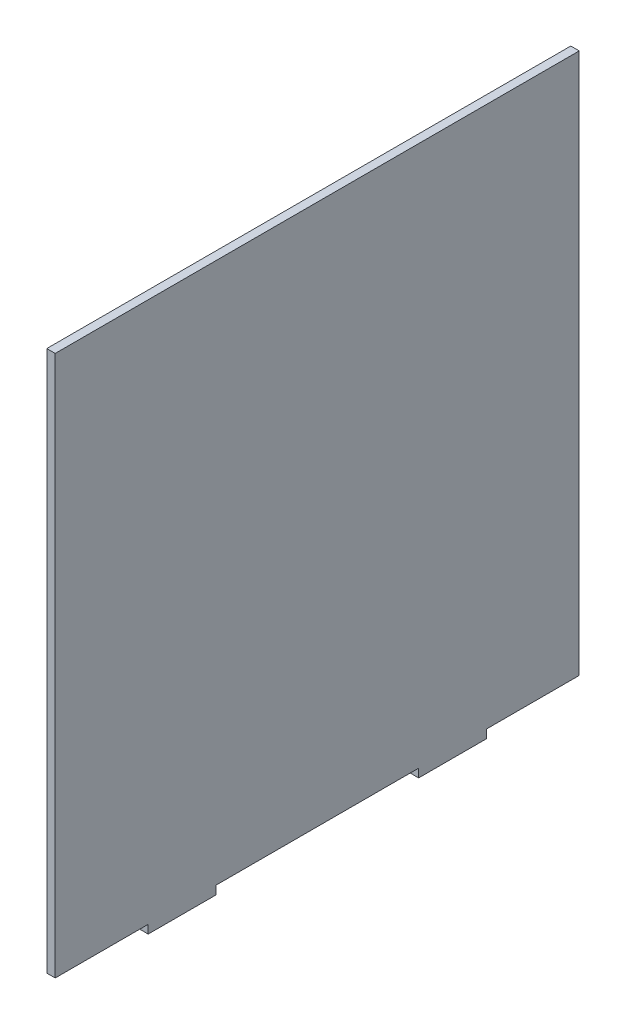
ISO-10303-21;
HEADER;
FILE_DESCRIPTION(('STEP AP214'),'2;1');
FILE_NAME('part.step','',(''),(''),'','','');
FILE_SCHEMA(('AUTOMOTIVE_DESIGN { 1 0 10303 214 1 1 1 1 }'));
ENDSEC;
DATA;
#1=APPLICATION_CONTEXT('core data for automotive mechanical design processes');
#2=APPLICATION_PROTOCOL_DEFINITION('international standard','automotive_design',2000,#1);
#3=PRODUCT_CONTEXT('',#1,'mechanical');
#4=PRODUCT('Part','Part','',(#3));
#5=PRODUCT_RELATED_PRODUCT_CATEGORY('part','',(#4));
#6=PRODUCT_DEFINITION_FORMATION('','',#4);
#7=PRODUCT_DEFINITION_CONTEXT('part definition',#1,'design');
#8=PRODUCT_DEFINITION('design','',#6,#7);
#9=PRODUCT_DEFINITION_SHAPE('','',#8);
#10=(LENGTH_UNIT() NAMED_UNIT(*) SI_UNIT(.MILLI.,.METRE.));
#11=(NAMED_UNIT(*) PLANE_ANGLE_UNIT() SI_UNIT($,.RADIAN.));
#12=(NAMED_UNIT(*) SI_UNIT($,.STERADIAN.) SOLID_ANGLE_UNIT());
#13=UNCERTAINTY_MEASURE_WITH_UNIT(LENGTH_MEASURE(1.E-05),#10,'distance_accuracy_value','');
#14=(GEOMETRIC_REPRESENTATION_CONTEXT(3) GLOBAL_UNCERTAINTY_ASSIGNED_CONTEXT((#13)) GLOBAL_UNIT_ASSIGNED_CONTEXT((#10,
#11,#12)) REPRESENTATION_CONTEXT('',''));
#15=CARTESIAN_POINT('',(0.,0.,0.));
#16=DIRECTION('',(0.,0.,1.));
#17=DIRECTION('',(1.,0.,0.));
#18=AXIS2_PLACEMENT_3D('',#15,#16,#17);
#19=CARTESIAN_POINT('',(3.175,0.,0.));
#20=DIRECTION('',(0.,1.,0.));
#21=DIRECTION('',(0.,0.,1.));
#22=AXIS2_PLACEMENT_3D('',#19,#20,#21);
#23=PLANE('',#22);
#24=DIRECTION('',(1.,0.,0.));
#25=VECTOR('',#24,1.);
#26=CARTESIAN_POINT('',(0.,0.,-161.925));
#27=LINE('',#26,#25);
#28=CARTESIAN_POINT('',(0.,0.,-161.925));
#29=VERTEX_POINT('',#28);
#30=CARTESIAN_POINT('',(3.175,0.,-161.925));
#31=VERTEX_POINT('',#30);
#32=EDGE_CURVE('E148',#29,#31,#27,.T.);
#33=ORIENTED_EDGE('',*,*,#32,.F.);
#34=DIRECTION('',(0.,0.,-1.));
#35=VECTOR('',#34,1.);
#36=CARTESIAN_POINT('',(0.,0.,0.));
#37=LINE('',#36,#35);
#38=CARTESIAN_POINT('',(0.,0.,-196.85));
#39=VERTEX_POINT('',#38);
#40=EDGE_CURVE('E134',#29,#39,#37,.T.);
#41=ORIENTED_EDGE('',*,*,#40,.T.);
#42=DIRECTION('',(-1.,0.,0.));
#43=VECTOR('',#42,1.);
#44=CARTESIAN_POINT('',(3.175,0.,-196.85));
#45=LINE('',#44,#43);
#46=CARTESIAN_POINT('',(3.175,0.,-196.85));
#47=VERTEX_POINT('',#46);
#48=EDGE_CURVE('E52',#47,#39,#45,.T.);
#49=ORIENTED_EDGE('',*,*,#48,.F.);
#50=DIRECTION('',(0.,0.,-1.));
#51=VECTOR('',#50,1.);
#52=CARTESIAN_POINT('',(3.175,0.,0.));
#53=LINE('',#52,#51);
#54=EDGE_CURVE('E59',#31,#47,#53,.T.);
#55=ORIENTED_EDGE('',*,*,#54,.F.);
#56=EDGE_LOOP('',(#33,#41,#49,#55));
#57=FACE_BOUND('',#56,.T.);
#58=ADVANCED_FACE('F43',(#57),#23,.F.);
#59=DIRECTION('',(-1.,0.,0.));
#60=VECTOR('',#59,1.);
#61=CARTESIAN_POINT('',(0.,0.,-136.525));
#62=LINE('',#61,#60);
#63=CARTESIAN_POINT('',(3.175,0.,-136.525));
#64=VERTEX_POINT('',#63);
#65=CARTESIAN_POINT('',(0.,0.,-136.525));
#66=VERTEX_POINT('',#65);
#67=EDGE_CURVE('E67',#64,#66,#62,.T.);
#68=ORIENTED_EDGE('',*,*,#67,.F.);
#69=CARTESIAN_POINT('',(3.175,0.,-60.325));
#70=VERTEX_POINT('',#69);
#71=EDGE_CURVE('E231',#70,#64,#53,.T.);
#72=ORIENTED_EDGE('',*,*,#71,.F.);
#73=DIRECTION('',(1.,0.,0.));
#74=VECTOR('',#73,1.);
#75=CARTESIAN_POINT('',(0.,0.,-60.325));
#76=LINE('',#75,#74);
#77=CARTESIAN_POINT('',(0.,0.,-60.325));
#78=VERTEX_POINT('',#77);
#79=EDGE_CURVE('E153',#78,#70,#76,.T.);
#80=ORIENTED_EDGE('',*,*,#79,.F.);
#81=EDGE_CURVE('E144',#78,#66,#37,.T.);
#82=ORIENTED_EDGE('',*,*,#81,.T.);
#83=EDGE_LOOP('',(#68,#72,#80,#82));
#84=FACE_BOUND('',#83,.T.);
#85=ADVANCED_FACE('F303',(#84),#23,.F.);
#86=DIRECTION('',(-1.,0.,0.));
#87=VECTOR('',#86,1.);
#88=CARTESIAN_POINT('',(0.,0.,-34.925));
#89=LINE('',#88,#87);
#90=CARTESIAN_POINT('',(3.175,0.,-34.925));
#91=VERTEX_POINT('',#90);
#92=CARTESIAN_POINT('',(0.,0.,-34.925));
#93=VERTEX_POINT('',#92);
#94=EDGE_CURVE('E190',#91,#93,#89,.T.);
#95=ORIENTED_EDGE('',*,*,#94,.F.);
#96=CARTESIAN_POINT('',(3.175,0.,0.));
#97=VERTEX_POINT('',#96);
#98=EDGE_CURVE('E226',#97,#91,#53,.T.);
#99=ORIENTED_EDGE('',*,*,#98,.F.);
#100=DIRECTION('',(-1.,0.,0.));
#101=VECTOR('',#100,1.);
#102=CARTESIAN_POINT('',(3.175,0.,0.));
#103=LINE('',#102,#101);
#104=CARTESIAN_POINT('',(0.,0.,0.));
#105=VERTEX_POINT('',#104);
#106=EDGE_CURVE('E11',#97,#105,#103,.T.);
#107=ORIENTED_EDGE('',*,*,#106,.T.);
#108=EDGE_CURVE('E147',#105,#93,#37,.T.);
#109=ORIENTED_EDGE('',*,*,#108,.T.);
#110=EDGE_LOOP('',(#95,#99,#107,#109));
#111=FACE_BOUND('',#110,.T.);
#112=ADVANCED_FACE('F287',(#111),#23,.F.);
#113=CARTESIAN_POINT('',(3.175,0.,0.));
#114=DIRECTION('',(0.,0.,-1.));
#115=DIRECTION('',(-1.,0.,0.));
#116=AXIS2_PLACEMENT_3D('',#113,#114,#115);
#117=PLANE('',#116);
#118=DIRECTION('',(0.,-1.,0.));
#119=VECTOR('',#118,1.);
#120=CARTESIAN_POINT('',(0.,0.,0.));
#121=LINE('',#120,#119);
#122=CARTESIAN_POINT('',(0.,203.2,0.));
#123=VERTEX_POINT('',#122);
#124=EDGE_CURVE('E145',#123,#105,#121,.T.);
#125=ORIENTED_EDGE('',*,*,#124,.T.);
#126=ORIENTED_EDGE('',*,*,#106,.F.);
#127=DIRECTION('',(0.,-1.,0.));
#128=VECTOR('',#127,1.);
#129=CARTESIAN_POINT('',(3.175,0.,0.));
#130=LINE('',#129,#128);
#131=CARTESIAN_POINT('',(3.175,203.2,0.));
#132=VERTEX_POINT('',#131);
#133=EDGE_CURVE('E221',#132,#97,#130,.T.);
#134=ORIENTED_EDGE('',*,*,#133,.F.);
#135=DIRECTION('',(-1.,0.,0.));
#136=VECTOR('',#135,1.);
#137=CARTESIAN_POINT('',(3.175,203.2,0.));
#138=LINE('',#137,#136);
#139=EDGE_CURVE('E237',#132,#123,#138,.T.);
#140=ORIENTED_EDGE('',*,*,#139,.T.);
#141=EDGE_LOOP('',(#125,#126,#134,#140));
#142=FACE_BOUND('',#141,.T.);
#143=ADVANCED_FACE('F45',(#142),#117,.F.);
#144=CARTESIAN_POINT('',(3.175,0.,-196.85));
#145=DIRECTION('',(0.,0.,1.));
#146=DIRECTION('',(1.,0.,0.));
#147=AXIS2_PLACEMENT_3D('',#144,#145,#146);
#148=PLANE('',#147);
#149=DIRECTION('',(0.,1.,0.));
#150=VECTOR('',#149,1.);
#151=CARTESIAN_POINT('',(0.,0.,-196.85));
#152=LINE('',#151,#150);
#153=CARTESIAN_POINT('',(0.,203.2,-196.85));
#154=VERTEX_POINT('',#153);
#155=EDGE_CURVE('E141',#39,#154,#152,.T.);
#156=ORIENTED_EDGE('',*,*,#155,.T.);
#157=DIRECTION('',(-1.,0.,0.));
#158=VECTOR('',#157,1.);
#159=CARTESIAN_POINT('',(3.175,203.2,-196.85));
#160=LINE('',#159,#158);
#161=CARTESIAN_POINT('',(3.175,203.2,-196.85));
#162=VERTEX_POINT('',#161);
#163=EDGE_CURVE('E249',#162,#154,#160,.T.);
#164=ORIENTED_EDGE('',*,*,#163,.F.);
#165=DIRECTION('',(0.,1.,0.));
#166=VECTOR('',#165,1.);
#167=CARTESIAN_POINT('',(3.175,0.,-196.85));
#168=LINE('',#167,#166);
#169=EDGE_CURVE('E230',#47,#162,#168,.T.);
#170=ORIENTED_EDGE('',*,*,#169,.F.);
#171=ORIENTED_EDGE('',*,*,#48,.T.);
#172=EDGE_LOOP('',(#156,#164,#170,#171));
#173=FACE_BOUND('',#172,.T.);
#174=ADVANCED_FACE('F255',(#173),#148,.F.);
#175=CARTESIAN_POINT('',(3.175,203.2,0.));
#176=DIRECTION('',(0.,-1.,0.));
#177=DIRECTION('',(0.,0.,-1.));
#178=AXIS2_PLACEMENT_3D('',#175,#176,#177);
#179=PLANE('',#178);
#180=DIRECTION('',(0.,0.,1.));
#181=VECTOR('',#180,1.);
#182=CARTESIAN_POINT('',(0.,203.2,0.));
#183=LINE('',#182,#181);
#184=EDGE_CURVE('E225',#154,#123,#183,.T.);
#185=ORIENTED_EDGE('',*,*,#184,.T.);
#186=ORIENTED_EDGE('',*,*,#139,.F.);
#187=DIRECTION('',(0.,0.,1.));
#188=VECTOR('',#187,1.);
#189=CARTESIAN_POINT('',(3.175,203.2,0.));
#190=LINE('',#189,#188);
#191=EDGE_CURVE('E234',#162,#132,#190,.T.);
#192=ORIENTED_EDGE('',*,*,#191,.F.);
#193=ORIENTED_EDGE('',*,*,#163,.T.);
#194=EDGE_LOOP('',(#185,#186,#192,#193));
#195=FACE_BOUND('',#194,.T.);
#196=ADVANCED_FACE('F292',(#195),#179,.F.);
#197=CARTESIAN_POINT('',(3.175,0.,0.));
#198=DIRECTION('',(-1.,0.,0.));
#199=DIRECTION('',(0.,0.,1.));
#200=AXIS2_PLACEMENT_3D('',#197,#198,#199);
#201=PLANE('',#200);
#202=ORIENTED_EDGE('',*,*,#133,.T.);
#203=ORIENTED_EDGE('',*,*,#98,.T.);
#204=DIRECTION('',(0.,1.,0.));
#205=VECTOR('',#204,1.);
#206=CARTESIAN_POINT('',(3.175,-3.175,-34.925));
#207=LINE('',#206,#205);
#208=CARTESIAN_POINT('',(3.175,-3.175,-34.925));
#209=VERTEX_POINT('',#208);
#210=EDGE_CURVE('E209',#209,#91,#207,.T.);
#211=ORIENTED_EDGE('',*,*,#210,.F.);
#212=DIRECTION('',(0.,0.,1.));
#213=VECTOR('',#212,1.);
#214=CARTESIAN_POINT('',(3.175,-3.175,-34.925));
#215=LINE('',#214,#213);
#216=CARTESIAN_POINT('',(3.175,-3.175,-60.325));
#217=VERTEX_POINT('',#216);
#218=EDGE_CURVE('E193',#217,#209,#215,.T.);
#219=ORIENTED_EDGE('',*,*,#218,.F.);
#220=DIRECTION('',(0.,1.,0.));
#221=VECTOR('',#220,1.);
#222=CARTESIAN_POINT('',(3.175,-3.175,-60.325));
#223=LINE('',#222,#221);
#224=EDGE_CURVE('E213',#217,#70,#223,.T.);
#225=ORIENTED_EDGE('',*,*,#224,.T.);
#226=ORIENTED_EDGE('',*,*,#71,.T.);
#227=DIRECTION('',(0.,1.,0.));
#228=VECTOR('',#227,1.);
#229=CARTESIAN_POINT('',(3.175,-3.175,-136.525));
#230=LINE('',#229,#228);
#231=CARTESIAN_POINT('',(3.175,-3.175,-136.525));
#232=VERTEX_POINT('',#231);
#233=EDGE_CURVE('E162',#232,#64,#230,.T.);
#234=ORIENTED_EDGE('',*,*,#233,.F.);
#235=DIRECTION('',(0.,0.,1.));
#236=VECTOR('',#235,1.);
#237=CARTESIAN_POINT('',(3.175,-3.175,-136.525));
#238=LINE('',#237,#236);
#239=CARTESIAN_POINT('',(3.175,-3.175,-161.925));
#240=VERTEX_POINT('',#239);
#241=EDGE_CURVE('E178',#240,#232,#238,.T.);
#242=ORIENTED_EDGE('',*,*,#241,.F.);
#243=DIRECTION('',(0.,1.,0.));
#244=VECTOR('',#243,1.);
#245=CARTESIAN_POINT('',(3.175,-3.175,-161.925));
#246=LINE('',#245,#244);
#247=EDGE_CURVE('E159',#240,#31,#246,.T.);
#248=ORIENTED_EDGE('',*,*,#247,.T.);
#249=ORIENTED_EDGE('',*,*,#54,.T.);
#250=ORIENTED_EDGE('',*,*,#169,.T.);
#251=ORIENTED_EDGE('',*,*,#191,.T.);
#252=EDGE_LOOP('',(#202,#203,#211,#219,#225,#226,#234,#242,#248,#249,#250,#251));
#253=FACE_BOUND('',#252,.T.);
#254=ADVANCED_FACE('F259',(#253),#201,.F.);
#255=CARTESIAN_POINT('',(0.,0.,0.));
#256=DIRECTION('',(-1.,0.,0.));
#257=DIRECTION('',(0.,0.,1.));
#258=AXIS2_PLACEMENT_3D('',#255,#256,#257);
#259=PLANE('',#258);
#260=ORIENTED_EDGE('',*,*,#124,.F.);
#261=ORIENTED_EDGE('',*,*,#184,.F.);
#262=ORIENTED_EDGE('',*,*,#155,.F.);
#263=ORIENTED_EDGE('',*,*,#40,.F.);
#264=DIRECTION('',(0.,1.,0.));
#265=VECTOR('',#264,1.);
#266=CARTESIAN_POINT('',(0.,-3.175,-161.925));
#267=LINE('',#266,#265);
#268=CARTESIAN_POINT('',(0.,-3.175,-161.925));
#269=VERTEX_POINT('',#268);
#270=EDGE_CURVE('E139',#269,#29,#267,.T.);
#271=ORIENTED_EDGE('',*,*,#270,.F.);
#272=DIRECTION('',(0.,0.,-1.));
#273=VECTOR('',#272,1.);
#274=CARTESIAN_POINT('',(0.,-3.175,-136.525));
#275=LINE('',#274,#273);
#276=CARTESIAN_POINT('',(0.,-3.175,-136.525));
#277=VERTEX_POINT('',#276);
#278=EDGE_CURVE('E174',#277,#269,#275,.T.);
#279=ORIENTED_EDGE('',*,*,#278,.F.);
#280=DIRECTION('',(0.,1.,0.));
#281=VECTOR('',#280,1.);
#282=CARTESIAN_POINT('',(0.,-3.175,-136.525));
#283=LINE('',#282,#281);
#284=EDGE_CURVE('E168',#277,#66,#283,.T.);
#285=ORIENTED_EDGE('',*,*,#284,.T.);
#286=ORIENTED_EDGE('',*,*,#81,.F.);
#287=DIRECTION('',(0.,1.,0.));
#288=VECTOR('',#287,1.);
#289=CARTESIAN_POINT('',(0.,-3.175,-60.325));
#290=LINE('',#289,#288);
#291=CARTESIAN_POINT('',(0.,-3.175,-60.325));
#292=VERTEX_POINT('',#291);
#293=EDGE_CURVE('E217',#292,#78,#290,.T.);
#294=ORIENTED_EDGE('',*,*,#293,.F.);
#295=DIRECTION('',(0.,0.,-1.));
#296=VECTOR('',#295,1.);
#297=CARTESIAN_POINT('',(0.,-3.175,-34.925));
#298=LINE('',#297,#296);
#299=CARTESIAN_POINT('',(0.,-3.175,-34.925));
#300=VERTEX_POINT('',#299);
#301=EDGE_CURVE('E185',#300,#292,#298,.T.);
#302=ORIENTED_EDGE('',*,*,#301,.F.);
#303=DIRECTION('',(0.,1.,0.));
#304=VECTOR('',#303,1.);
#305=CARTESIAN_POINT('',(0.,-3.175,-34.925));
#306=LINE('',#305,#304);
#307=EDGE_CURVE('E199',#300,#93,#306,.T.);
#308=ORIENTED_EDGE('',*,*,#307,.T.);
#309=ORIENTED_EDGE('',*,*,#108,.F.);
#310=EDGE_LOOP('',(#260,#261,#262,#263,#271,#279,#285,#286,#294,#302,#308,#309));
#311=FACE_BOUND('',#310,.T.);
#312=ADVANCED_FACE('F136',(#311),#259,.T.);
#313=CARTESIAN_POINT('',(0.,-3.175,-60.325));
#314=DIRECTION('',(0.,0.,1.));
#315=DIRECTION('',(1.,0.,0.));
#316=AXIS2_PLACEMENT_3D('',#313,#314,#315);
#317=PLANE('',#316);
#318=ORIENTED_EDGE('',*,*,#79,.T.);
#319=ORIENTED_EDGE('',*,*,#224,.F.);
#320=DIRECTION('',(1.,0.,0.));
#321=VECTOR('',#320,1.);
#322=CARTESIAN_POINT('',(0.,-3.175,-60.325));
#323=LINE('',#322,#321);
#324=EDGE_CURVE('E189',#292,#217,#323,.T.);
#325=ORIENTED_EDGE('',*,*,#324,.F.);
#326=ORIENTED_EDGE('',*,*,#293,.T.);
#327=EDGE_LOOP('',(#318,#319,#325,#326));
#328=FACE_BOUND('',#327,.T.);
#329=ADVANCED_FACE('F278',(#328),#317,.F.);
#330=CARTESIAN_POINT('',(0.,-3.175,-34.925));
#331=DIRECTION('',(0.,0.,-1.));
#332=DIRECTION('',(-1.,0.,0.));
#333=AXIS2_PLACEMENT_3D('',#330,#331,#332);
#334=PLANE('',#333);
#335=ORIENTED_EDGE('',*,*,#94,.T.);
#336=ORIENTED_EDGE('',*,*,#307,.F.);
#337=DIRECTION('',(-1.,0.,0.));
#338=VECTOR('',#337,1.);
#339=CARTESIAN_POINT('',(0.,-3.175,-34.925));
#340=LINE('',#339,#338);
#341=EDGE_CURVE('E196',#209,#300,#340,.T.);
#342=ORIENTED_EDGE('',*,*,#341,.F.);
#343=ORIENTED_EDGE('',*,*,#210,.T.);
#344=EDGE_LOOP('',(#335,#336,#342,#343));
#345=FACE_BOUND('',#344,.T.);
#346=ADVANCED_FACE('F284',(#345),#334,.F.);
#347=CARTESIAN_POINT('',(0.,-3.175,0.));
#348=DIRECTION('',(0.,-1.,0.));
#349=DIRECTION('',(0.,0.,-1.));
#350=AXIS2_PLACEMENT_3D('',#347,#348,#349);
#351=PLANE('',#350);
#352=ORIENTED_EDGE('',*,*,#301,.T.);
#353=ORIENTED_EDGE('',*,*,#324,.T.);
#354=ORIENTED_EDGE('',*,*,#218,.T.);
#355=ORIENTED_EDGE('',*,*,#341,.T.);
#356=EDGE_LOOP('',(#352,#353,#354,#355));
#357=FACE_BOUND('',#356,.T.);
#358=ADVANCED_FACE('F280',(#357),#351,.T.);
#359=CARTESIAN_POINT('',(0.,-3.175,-161.925));
#360=DIRECTION('',(0.,0.,1.));
#361=DIRECTION('',(1.,0.,0.));
#362=AXIS2_PLACEMENT_3D('',#359,#360,#361);
#363=PLANE('',#362);
#364=ORIENTED_EDGE('',*,*,#32,.T.);
#365=ORIENTED_EDGE('',*,*,#247,.F.);
#366=DIRECTION('',(1.,0.,0.));
#367=VECTOR('',#366,1.);
#368=CARTESIAN_POINT('',(0.,-3.175,-161.925));
#369=LINE('',#368,#367);
#370=EDGE_CURVE('E156',#269,#240,#369,.T.);
#371=ORIENTED_EDGE('',*,*,#370,.F.);
#372=ORIENTED_EDGE('',*,*,#270,.T.);
#373=EDGE_LOOP('',(#364,#365,#371,#372));
#374=FACE_BOUND('',#373,.T.);
#375=ADVANCED_FACE('F155',(#374),#363,.F.);
#376=CARTESIAN_POINT('',(0.,-3.175,-136.525));
#377=DIRECTION('',(0.,0.,-1.));
#378=DIRECTION('',(-1.,0.,0.));
#379=AXIS2_PLACEMENT_3D('',#376,#377,#378);
#380=PLANE('',#379);
#381=ORIENTED_EDGE('',*,*,#67,.T.);
#382=ORIENTED_EDGE('',*,*,#284,.F.);
#383=DIRECTION('',(-1.,0.,0.));
#384=VECTOR('',#383,1.);
#385=CARTESIAN_POINT('',(0.,-3.175,-136.525));
#386=LINE('',#385,#384);
#387=EDGE_CURVE('E172',#232,#277,#386,.T.);
#388=ORIENTED_EDGE('',*,*,#387,.F.);
#389=ORIENTED_EDGE('',*,*,#233,.T.);
#390=EDGE_LOOP('',(#381,#382,#388,#389));
#391=FACE_BOUND('',#390,.T.);
#392=ADVANCED_FACE('F269',(#391),#380,.F.);
#393=CARTESIAN_POINT('',(0.,-3.175,0.));
#394=DIRECTION('',(0.,-1.,0.));
#395=DIRECTION('',(0.,0.,-1.));
#396=AXIS2_PLACEMENT_3D('',#393,#394,#395);
#397=PLANE('',#396);
#398=ORIENTED_EDGE('',*,*,#278,.T.);
#399=ORIENTED_EDGE('',*,*,#370,.T.);
#400=ORIENTED_EDGE('',*,*,#241,.T.);
#401=ORIENTED_EDGE('',*,*,#387,.T.);
#402=EDGE_LOOP('',(#398,#399,#400,#401));
#403=FACE_BOUND('',#402,.T.);
#404=ADVANCED_FACE('F272',(#403),#397,.T.);
#405=CLOSED_SHELL('',(#58,#85,#112,#143,#174,#196,#254,#312,#329,#346,#358,#375,#392,#404));
#406=MANIFOLD_SOLID_BREP('B2',#405);
#407=ADVANCED_BREP_SHAPE_REPRESENTATION('',(#18,#406),#14);
#408=SHAPE_DEFINITION_REPRESENTATION(#9,#407);
ENDSEC;
END-ISO-10303-21;
